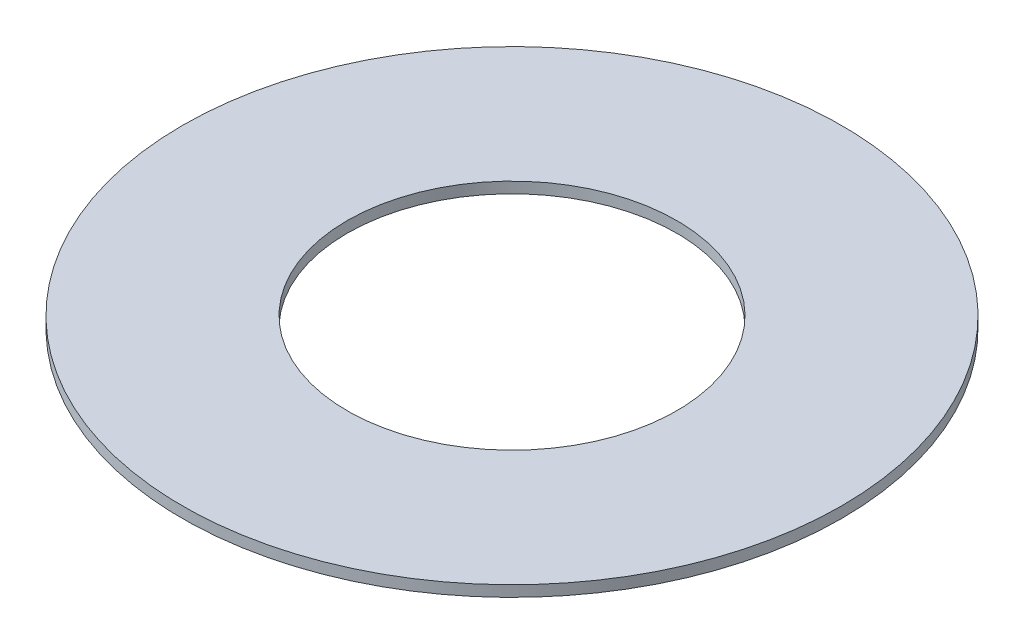
ISO-10303-21;
HEADER;
FILE_DESCRIPTION(('STEP AP214'),'2;1');
FILE_NAME('part.step','',(''),(''),'','','');
FILE_SCHEMA(('AUTOMOTIVE_DESIGN { 1 0 10303 214 1 1 1 1 }'));
ENDSEC;
DATA;
#1=APPLICATION_CONTEXT('core data for automotive mechanical design processes');
#2=APPLICATION_PROTOCOL_DEFINITION('international standard','automotive_design',2000,#1);
#3=PRODUCT_CONTEXT('',#1,'mechanical');
#4=PRODUCT('Part','Part','',(#3));
#5=PRODUCT_RELATED_PRODUCT_CATEGORY('part','',(#4));
#6=PRODUCT_DEFINITION_FORMATION('','',#4);
#7=PRODUCT_DEFINITION_CONTEXT('part definition',#1,'design');
#8=PRODUCT_DEFINITION('design','',#6,#7);
#9=PRODUCT_DEFINITION_SHAPE('','',#8);
#10=(LENGTH_UNIT() NAMED_UNIT(*) SI_UNIT(.MILLI.,.METRE.));
#11=(NAMED_UNIT(*) PLANE_ANGLE_UNIT() SI_UNIT($,.RADIAN.));
#12=(NAMED_UNIT(*) SI_UNIT($,.STERADIAN.) SOLID_ANGLE_UNIT());
#13=UNCERTAINTY_MEASURE_WITH_UNIT(LENGTH_MEASURE(1.E-05),#10,'distance_accuracy_value','');
#14=(GEOMETRIC_REPRESENTATION_CONTEXT(3) GLOBAL_UNCERTAINTY_ASSIGNED_CONTEXT((#13)) GLOBAL_UNIT_ASSIGNED_CONTEXT((#10,
#11,#12)) REPRESENTATION_CONTEXT('',''));
#15=CARTESIAN_POINT('',(0.,0.,0.));
#16=DIRECTION('',(0.,0.,1.));
#17=DIRECTION('',(1.,0.,0.));
#18=AXIS2_PLACEMENT_3D('',#15,#16,#17);
#19=CARTESIAN_POINT('',(0.,0.,0.));
#20=DIRECTION('',(0.,1.,0.));
#21=DIRECTION('',(-1.,0.,0.));
#22=AXIS2_PLACEMENT_3D('',#19,#20,#21);
#23=PLANE('',#22);
#24=CARTESIAN_POINT('',(0.,0.,0.));
#25=DIRECTION('',(0.,-1.,0.));
#26=DIRECTION('',(1.,0.,0.));
#27=AXIS2_PLACEMENT_3D('',#24,#25,#26);
#28=CIRCLE('',#27,6.);
#29=CARTESIAN_POINT('',(6.,0.,0.));
#30=VERTEX_POINT('',#29);
#31=EDGE_CURVE('E27',#30,#30,#28,.F.);
#32=ORIENTED_EDGE('',*,*,#31,.F.);
#33=EDGE_LOOP('',(#32));
#34=FACE_BOUND('',#33,.T.);
#35=CARTESIAN_POINT('',(0.,0.,0.));
#36=DIRECTION('',(0.,1.,0.));
#37=DIRECTION('',(-1.,0.,0.));
#38=AXIS2_PLACEMENT_3D('',#35,#36,#37);
#39=CIRCLE('',#38,3.);
#40=CARTESIAN_POINT('',(-3.,0.,0.));
#41=VERTEX_POINT('',#40);
#42=EDGE_CURVE('E18',#41,#41,#39,.T.);
#43=ORIENTED_EDGE('',*,*,#42,.T.);
#44=EDGE_LOOP('',(#43));
#45=FACE_BOUND('',#44,.T.);
#46=ADVANCED_FACE('F15',(#34,#45),#23,.F.);
#47=CARTESIAN_POINT('',(0.,0.,0.));
#48=DIRECTION('',(0.,1.,0.));
#49=DIRECTION('',(-1.,0.,0.));
#50=AXIS2_PLACEMENT_3D('',#47,#48,#49);
#51=CYLINDRICAL_SURFACE('',#50,3.);
#52=CARTESIAN_POINT('',(0.,0.199999999999978,0.));
#53=DIRECTION('',(0.,1.,0.));
#54=DIRECTION('',(-1.,0.,0.));
#55=AXIS2_PLACEMENT_3D('',#52,#53,#54);
#56=CIRCLE('',#55,3.);
#57=CARTESIAN_POINT('',(-3.,0.199999999999978,0.));
#58=VERTEX_POINT('',#57);
#59=EDGE_CURVE('E22',#58,#58,#56,.F.);
#60=ORIENTED_EDGE('',*,*,#59,.F.);
#61=EDGE_LOOP('',(#60));
#62=FACE_BOUND('',#61,.T.);
#63=ORIENTED_EDGE('',*,*,#42,.F.);
#64=EDGE_LOOP('',(#63));
#65=FACE_BOUND('',#64,.T.);
#66=ADVANCED_FACE('F36',(#62,#65),#51,.F.);
#67=CARTESIAN_POINT('',(0.,0.199999999999978,0.));
#68=DIRECTION('',(0.,-1.,0.));
#69=DIRECTION('',(1.,0.,0.));
#70=AXIS2_PLACEMENT_3D('',#67,#68,#69);
#71=CYLINDRICAL_SURFACE('',#70,6.);
#72=ORIENTED_EDGE('',*,*,#31,.T.);
#73=EDGE_LOOP('',(#72));
#74=FACE_BOUND('',#73,.T.);
#75=CARTESIAN_POINT('',(0.,0.199999999999978,0.));
#76=DIRECTION('',(0.,-1.,0.));
#77=DIRECTION('',(1.,0.,0.));
#78=AXIS2_PLACEMENT_3D('',#75,#76,#77);
#79=CIRCLE('',#78,6.);
#80=CARTESIAN_POINT('',(6.,0.199999999999978,0.));
#81=VERTEX_POINT('',#80);
#82=EDGE_CURVE('E10',#81,#81,#79,.F.);
#83=ORIENTED_EDGE('',*,*,#82,.F.);
#84=EDGE_LOOP('',(#83));
#85=FACE_BOUND('',#84,.T.);
#86=ADVANCED_FACE('F38',(#74,#85),#71,.T.);
#87=CARTESIAN_POINT('',(0.,0.199999999999978,0.));
#88=DIRECTION('',(0.,1.,0.));
#89=DIRECTION('',(-1.,0.,0.));
#90=AXIS2_PLACEMENT_3D('',#87,#88,#89);
#91=PLANE('',#90);
#92=ORIENTED_EDGE('',*,*,#82,.T.);
#93=EDGE_LOOP('',(#92));
#94=FACE_BOUND('',#93,.T.);
#95=ORIENTED_EDGE('',*,*,#59,.T.);
#96=EDGE_LOOP('',(#95));
#97=FACE_BOUND('',#96,.T.);
#98=ADVANCED_FACE('F45',(#94,#97),#91,.T.);
#99=CLOSED_SHELL('',(#46,#66,#86,#98));
#100=MANIFOLD_SOLID_BREP('B1',#99);
#101=ADVANCED_BREP_SHAPE_REPRESENTATION('',(#18,#100),#14);
#102=SHAPE_DEFINITION_REPRESENTATION(#9,#101);
ENDSEC;
END-ISO-10303-21;
